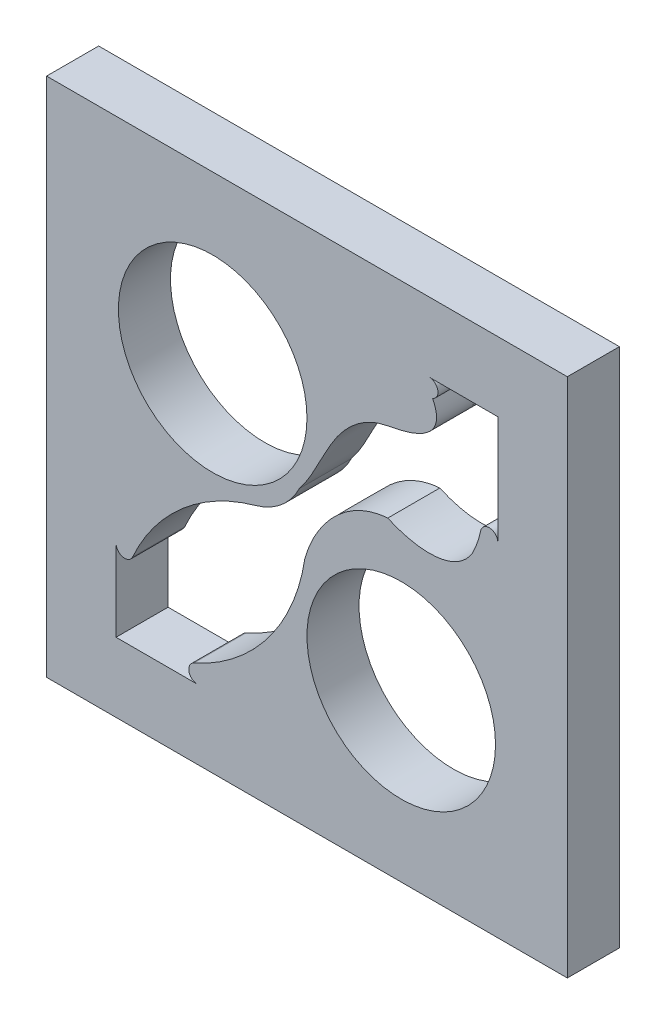
ISO-10303-21;
HEADER;
FILE_DESCRIPTION(('STEP AP214'),'2;1');
FILE_NAME('part.step','',(''),(''),'','','');
FILE_SCHEMA(('AUTOMOTIVE_DESIGN { 1 0 10303 214 1 1 1 1 }'));
ENDSEC;
DATA;
#1=APPLICATION_CONTEXT('core data for automotive mechanical design processes');
#2=APPLICATION_PROTOCOL_DEFINITION('international standard','automotive_design',2000,#1);
#3=PRODUCT_CONTEXT('',#1,'mechanical');
#4=PRODUCT('Part','Part','',(#3));
#5=PRODUCT_RELATED_PRODUCT_CATEGORY('part','',(#4));
#6=PRODUCT_DEFINITION_FORMATION('','',#4);
#7=PRODUCT_DEFINITION_CONTEXT('part definition',#1,'design');
#8=PRODUCT_DEFINITION('design','',#6,#7);
#9=PRODUCT_DEFINITION_SHAPE('','',#8);
#10=(LENGTH_UNIT() NAMED_UNIT(*) SI_UNIT(.MILLI.,.METRE.));
#11=(NAMED_UNIT(*) PLANE_ANGLE_UNIT() SI_UNIT($,.RADIAN.));
#12=(NAMED_UNIT(*) SI_UNIT($,.STERADIAN.) SOLID_ANGLE_UNIT());
#13=UNCERTAINTY_MEASURE_WITH_UNIT(LENGTH_MEASURE(1.E-05),#10,'distance_accuracy_value','');
#14=(GEOMETRIC_REPRESENTATION_CONTEXT(3) GLOBAL_UNCERTAINTY_ASSIGNED_CONTEXT((#13)) GLOBAL_UNIT_ASSIGNED_CONTEXT((#10,
#11,#12)) REPRESENTATION_CONTEXT('',''));
#15=CARTESIAN_POINT('',(0.,0.,0.));
#16=DIRECTION('',(0.,0.,1.));
#17=DIRECTION('',(1.,0.,0.));
#18=AXIS2_PLACEMENT_3D('',#15,#16,#17);
#19=CARTESIAN_POINT('',(15.,0.,3.));
#20=DIRECTION('',(1.,0.,0.));
#21=DIRECTION('',(0.,0.,-1.));
#22=AXIS2_PLACEMENT_3D('',#19,#20,#21);
#23=PLANE('',#22);
#24=DIRECTION('',(0.,-1.,0.));
#25=VECTOR('',#24,1.);
#26=CARTESIAN_POINT('',(15.,0.,0.));
#27=LINE('',#26,#25);
#28=CARTESIAN_POINT('',(15.,15.,0.));
#29=VERTEX_POINT('',#28);
#30=CARTESIAN_POINT('',(15.,-15.,0.));
#31=VERTEX_POINT('',#30);
#32=EDGE_CURVE('E348',#29,#31,#27,.T.);
#33=ORIENTED_EDGE('',*,*,#32,.F.);
#34=DIRECTION('',(0.,0.,-1.));
#35=VECTOR('',#34,1.);
#36=CARTESIAN_POINT('',(15.,15.,3.));
#37=LINE('',#36,#35);
#38=CARTESIAN_POINT('',(15.,15.,3.));
#39=VERTEX_POINT('',#38);
#40=EDGE_CURVE('E11',#39,#29,#37,.T.);
#41=ORIENTED_EDGE('',*,*,#40,.F.);
#42=DIRECTION('',(0.,-1.,0.));
#43=VECTOR('',#42,1.);
#44=CARTESIAN_POINT('',(15.,0.,3.));
#45=LINE('',#44,#43);
#46=CARTESIAN_POINT('',(15.,-15.,3.));
#47=VERTEX_POINT('',#46);
#48=EDGE_CURVE('E254',#39,#47,#45,.T.);
#49=ORIENTED_EDGE('',*,*,#48,.T.);
#50=DIRECTION('',(0.,0.,-1.));
#51=VECTOR('',#50,1.);
#52=CARTESIAN_POINT('',(15.,-15.,3.));
#53=LINE('',#52,#51);
#54=EDGE_CURVE('E162',#47,#31,#53,.T.);
#55=ORIENTED_EDGE('',*,*,#54,.T.);
#56=EDGE_LOOP('',(#33,#41,#49,#55));
#57=FACE_BOUND('',#56,.T.);
#58=ADVANCED_FACE('F48',(#57),#23,.T.);
#59=CARTESIAN_POINT('',(0.,15.,3.));
#60=DIRECTION('',(0.,1.,0.));
#61=DIRECTION('',(0.,0.,1.));
#62=AXIS2_PLACEMENT_3D('',#59,#60,#61);
#63=PLANE('',#62);
#64=DIRECTION('',(1.,0.,0.));
#65=VECTOR('',#64,1.);
#66=CARTESIAN_POINT('',(0.,15.,0.));
#67=LINE('',#66,#65);
#68=CARTESIAN_POINT('',(-15.,15.,0.));
#69=VERTEX_POINT('',#68);
#70=EDGE_CURVE('E241',#69,#29,#67,.T.);
#71=ORIENTED_EDGE('',*,*,#70,.F.);
#72=DIRECTION('',(0.,0.,-1.));
#73=VECTOR('',#72,1.);
#74=CARTESIAN_POINT('',(-15.,15.,3.));
#75=LINE('',#74,#73);
#76=CARTESIAN_POINT('',(-15.,15.,3.));
#77=VERTEX_POINT('',#76);
#78=EDGE_CURVE('E59',#77,#69,#75,.T.);
#79=ORIENTED_EDGE('',*,*,#78,.F.);
#80=DIRECTION('',(1.,0.,0.));
#81=VECTOR('',#80,1.);
#82=CARTESIAN_POINT('',(0.,15.,3.));
#83=LINE('',#82,#81);
#84=EDGE_CURVE('E239',#77,#39,#83,.T.);
#85=ORIENTED_EDGE('',*,*,#84,.T.);
#86=ORIENTED_EDGE('',*,*,#40,.T.);
#87=EDGE_LOOP('',(#71,#79,#85,#86));
#88=FACE_BOUND('',#87,.T.);
#89=ADVANCED_FACE('F237',(#88),#63,.T.);
#90=CARTESIAN_POINT('',(-15.,0.,3.));
#91=DIRECTION('',(1.,0.,0.));
#92=DIRECTION('',(0.,1.,0.));
#93=AXIS2_PLACEMENT_3D('',#90,#91,#92);
#94=PLANE('',#93);
#95=DIRECTION('',(0.,-1.,0.));
#96=VECTOR('',#95,1.);
#97=CARTESIAN_POINT('',(-15.,0.,0.));
#98=LINE('',#97,#96);
#99=CARTESIAN_POINT('',(-15.,-15.,0.));
#100=VERTEX_POINT('',#99);
#101=EDGE_CURVE('E353',#69,#100,#98,.T.);
#102=ORIENTED_EDGE('',*,*,#101,.T.);
#103=DIRECTION('',(0.,0.,-1.));
#104=VECTOR('',#103,1.);
#105=CARTESIAN_POINT('',(-15.,-15.,3.));
#106=LINE('',#105,#104);
#107=CARTESIAN_POINT('',(-15.,-15.,3.));
#108=VERTEX_POINT('',#107);
#109=EDGE_CURVE('E245',#108,#100,#106,.T.);
#110=ORIENTED_EDGE('',*,*,#109,.F.);
#111=DIRECTION('',(0.,-1.,0.));
#112=VECTOR('',#111,1.);
#113=CARTESIAN_POINT('',(-15.,0.,3.));
#114=LINE('',#113,#112);
#115=EDGE_CURVE('E248',#77,#108,#114,.T.);
#116=ORIENTED_EDGE('',*,*,#115,.F.);
#117=ORIENTED_EDGE('',*,*,#78,.T.);
#118=EDGE_LOOP('',(#102,#110,#116,#117));
#119=FACE_BOUND('',#118,.T.);
#120=ADVANCED_FACE('F249',(#119),#94,.F.);
#121=CARTESIAN_POINT('',(0.,-11.,3.));
#122=DIRECTION('',(0.,1.,0.));
#123=DIRECTION('',(0.,0.,1.));
#124=AXIS2_PLACEMENT_3D('',#121,#122,#123);
#125=PLANE('',#124);
#126=DIRECTION('',(1.,0.,0.));
#127=VECTOR('',#126,1.);
#128=CARTESIAN_POINT('',(0.,-11.,0.));
#129=LINE('',#128,#127);
#130=CARTESIAN_POINT('',(-11.,-11.,0.));
#131=VERTEX_POINT('',#130);
#132=CARTESIAN_POINT('',(-6.30958424017658,-11.,0.));
#133=VERTEX_POINT('',#132);
#134=EDGE_CURVE('E271',#131,#133,#129,.T.);
#135=ORIENTED_EDGE('',*,*,#134,.F.);
#136=DIRECTION('',(0.,0.,-1.));
#137=VECTOR('',#136,1.);
#138=CARTESIAN_POINT('',(-11.,-11.,3.));
#139=LINE('',#138,#137);
#140=CARTESIAN_POINT('',(-11.,-11.,3.));
#141=VERTEX_POINT('',#140);
#142=EDGE_CURVE('E52',#141,#131,#139,.T.);
#143=ORIENTED_EDGE('',*,*,#142,.F.);
#144=DIRECTION('',(1.,0.,0.));
#145=VECTOR('',#144,1.);
#146=CARTESIAN_POINT('',(0.,-11.,3.));
#147=LINE('',#146,#145);
#148=CARTESIAN_POINT('',(-6.30958424017658,-11.,3.));
#149=VERTEX_POINT('',#148);
#150=EDGE_CURVE('E362',#141,#149,#147,.T.);
#151=ORIENTED_EDGE('',*,*,#150,.T.);
#152=DIRECTION('',(0.,0.,-1.));
#153=VECTOR('',#152,1.);
#154=CARTESIAN_POINT('',(-6.30958424017658,-11.,3.));
#155=LINE('',#154,#153);
#156=EDGE_CURVE('E270',#149,#133,#155,.T.);
#157=ORIENTED_EDGE('',*,*,#156,.T.);
#158=EDGE_LOOP('',(#135,#143,#151,#157));
#159=FACE_BOUND('',#158,.T.);
#160=ADVANCED_FACE('F50',(#159),#125,.T.);
#161=CARTESIAN_POINT('',(-11.,0.,3.));
#162=DIRECTION('',(1.,0.,0.));
#163=DIRECTION('',(0.,0.,-1.));
#164=AXIS2_PLACEMENT_3D('',#161,#162,#163);
#165=PLANE('',#164);
#166=DIRECTION('',(0.,-1.,0.));
#167=VECTOR('',#166,1.);
#168=CARTESIAN_POINT('',(-11.,0.,0.));
#169=LINE('',#168,#167);
#170=CARTESIAN_POINT('',(-11.,-6.30958424017659,0.));
#171=VERTEX_POINT('',#170);
#172=EDGE_CURVE('E274',#171,#131,#169,.T.);
#173=ORIENTED_EDGE('',*,*,#172,.F.);
#174=DIRECTION('',(0.,0.,-1.));
#175=VECTOR('',#174,1.);
#176=CARTESIAN_POINT('',(-11.,-6.30958424017659,3.));
#177=LINE('',#176,#175);
#178=CARTESIAN_POINT('',(-11.,-6.30958424017659,3.));
#179=VERTEX_POINT('',#178);
#180=EDGE_CURVE('E405',#179,#171,#177,.T.);
#181=ORIENTED_EDGE('',*,*,#180,.F.);
#182=DIRECTION('',(0.,-1.,0.));
#183=VECTOR('',#182,1.);
#184=CARTESIAN_POINT('',(-11.,0.,3.));
#185=LINE('',#184,#183);
#186=EDGE_CURVE('E420',#179,#141,#185,.T.);
#187=ORIENTED_EDGE('',*,*,#186,.T.);
#188=ORIENTED_EDGE('',*,*,#142,.T.);
#189=EDGE_LOOP('',(#173,#181,#187,#188));
#190=FACE_BOUND('',#189,.T.);
#191=ADVANCED_FACE('F418',(#190),#165,.T.);
#192=CARTESIAN_POINT('',(-10.5,-6.30958424017659,3.));
#193=DIRECTION('',(0.,0.,-1.));
#194=DIRECTION('',(-1.,0.,0.));
#195=AXIS2_PLACEMENT_3D('',#192,#193,#194);
#196=CYLINDRICAL_SURFACE('',#195,0.500000000000001);
#197=CARTESIAN_POINT('',(-10.5,-6.30958424017659,0.));
#198=DIRECTION('',(0.,0.,1.));
#199=DIRECTION('',(1.,0.,0.));
#200=AXIS2_PLACEMENT_3D('',#197,#198,#199);
#201=CIRCLE('',#200,0.500000000000001);
#202=CARTESIAN_POINT('',(-10.0434782608695,-6.51351536016893,0.));
#203=VERTEX_POINT('',#202);
#204=EDGE_CURVE('E278',#171,#203,#201,.T.);
#205=ORIENTED_EDGE('',*,*,#204,.T.);
#206=DIRECTION('',(0.,0.,-1.));
#207=VECTOR('',#206,1.);
#208=CARTESIAN_POINT('',(-10.0434782608695,-6.51351536016893,3.));
#209=LINE('',#208,#207);
#210=CARTESIAN_POINT('',(-10.0434782608695,-6.51351536016893,3.));
#211=VERTEX_POINT('',#210);
#212=EDGE_CURVE('E402',#211,#203,#209,.T.);
#213=ORIENTED_EDGE('',*,*,#212,.F.);
#214=CARTESIAN_POINT('',(-10.5,-6.30958424017659,3.));
#215=DIRECTION('',(0.,0.,1.));
#216=DIRECTION('',(1.,0.,0.));
#217=AXIS2_PLACEMENT_3D('',#214,#215,#216);
#218=CIRCLE('',#217,0.500000000000001);
#219=EDGE_CURVE('E438',#179,#211,#218,.T.);
#220=ORIENTED_EDGE('',*,*,#219,.F.);
#221=ORIENTED_EDGE('',*,*,#180,.T.);
#222=EDGE_LOOP('',(#205,#213,#220,#221));
#223=FACE_BOUND('',#222,.T.);
#224=ADVANCED_FACE('F427',(#223),#196,.T.);
#225=CARTESIAN_POINT('',(7.75421393761633E-13,-11.0000000000002,3.));
#226=DIRECTION('',(0.,0.,-1.));
#227=DIRECTION('',(-1.,0.,0.));
#228=AXIS2_PLACEMENT_3D('',#225,#226,#227);
#229=CYLINDRICAL_SURFACE('',#228,11.0000000000007);
#230=CARTESIAN_POINT('',(7.75421393761633E-13,-11.0000000000002,0.));
#231=DIRECTION('',(0.,0.,1.));
#232=DIRECTION('',(1.,0.,0.));
#233=AXIS2_PLACEMENT_3D('',#230,#231,#232);
#234=CIRCLE('',#233,11.0000000000007);
#235=CARTESIAN_POINT('',(-2.96203037105047,-0.406304890125353,0.));
#236=VERTEX_POINT('',#235);
#237=EDGE_CURVE('E281',#203,#236,#234,.F.);
#238=ORIENTED_EDGE('',*,*,#237,.T.);
#239=DIRECTION('',(0.,0.,-1.));
#240=VECTOR('',#239,1.);
#241=CARTESIAN_POINT('',(-2.96203037105047,-0.406304890125353,3.));
#242=LINE('',#241,#240);
#243=CARTESIAN_POINT('',(-2.96203037105047,-0.406304890125353,3.));
#244=VERTEX_POINT('',#243);
#245=EDGE_CURVE('E399',#244,#236,#242,.T.);
#246=ORIENTED_EDGE('',*,*,#245,.F.);
#247=CARTESIAN_POINT('',(7.75421393761633E-13,-11.0000000000002,3.));
#248=DIRECTION('',(0.,0.,1.));
#249=DIRECTION('',(1.,0.,0.));
#250=AXIS2_PLACEMENT_3D('',#247,#248,#249);
#251=CIRCLE('',#250,11.0000000000007);
#252=EDGE_CURVE('E432',#211,#244,#251,.F.);
#253=ORIENTED_EDGE('',*,*,#252,.F.);
#254=ORIENTED_EDGE('',*,*,#212,.T.);
#255=EDGE_LOOP('',(#238,#246,#253,#254));
#256=FACE_BOUND('',#255,.T.);
#257=ADVANCED_FACE('F430',(#256),#229,.F.);
#258=CARTESIAN_POINT('',(-4.03913232415982,3.44594787710166,3.));
#259=DIRECTION('',(0.,0.,-1.));
#260=DIRECTION('',(-1.,0.,0.));
#261=AXIS2_PLACEMENT_3D('',#258,#259,#260);
#262=CYLINDRICAL_SURFACE('',#261,4.00000000000004);
#263=CARTESIAN_POINT('',(-4.03913232415982,3.44594787710166,0.));
#264=DIRECTION('',(0.,0.,1.));
#265=DIRECTION('',(1.,0.,0.));
#266=AXIS2_PLACEMENT_3D('',#263,#264,#265);
#267=CIRCLE('',#266,4.00000000000004);
#268=CARTESIAN_POINT('',(-0.446038310170015,1.68820062375979,0.));
#269=VERTEX_POINT('',#268);
#270=EDGE_CURVE('E285',#269,#236,#267,.F.);
#271=ORIENTED_EDGE('',*,*,#270,.F.);
#272=DIRECTION('',(0.,0.,-1.));
#273=VECTOR('',#272,1.);
#274=CARTESIAN_POINT('',(-0.446038310170015,1.68820062375979,3.));
#275=LINE('',#274,#273);
#276=CARTESIAN_POINT('',(-0.446038310170015,1.68820062375979,3.));
#277=VERTEX_POINT('',#276);
#278=EDGE_CURVE('E396',#277,#269,#275,.T.);
#279=ORIENTED_EDGE('',*,*,#278,.F.);
#280=CARTESIAN_POINT('',(-4.03913232415982,3.44594787710166,3.));
#281=DIRECTION('',(0.,0.,1.));
#282=DIRECTION('',(1.,0.,0.));
#283=AXIS2_PLACEMENT_3D('',#280,#281,#282);
#284=CIRCLE('',#283,4.00000000000004);
#285=EDGE_CURVE('E437',#277,#244,#284,.F.);
#286=ORIENTED_EDGE('',*,*,#285,.T.);
#287=ORIENTED_EDGE('',*,*,#245,.T.);
#288=EDGE_LOOP('',(#271,#279,#286,#287));
#289=FACE_BOUND('',#288,.T.);
#290=ADVANCED_FACE('F465',(#289),#262,.T.);
#291=CARTESIAN_POINT('',(-0.44603831017005,1.6882006237598,3.));
#292=CARTESIAN_POINT('',(0.60016147174152,2.9977804823151,3.));
#293=CARTESIAN_POINT('',(1.25953540510048,5.41260788195,3.));
#294=CARTESIAN_POINT('',(3.72349140835841,7.26877229624846,3.));
#295=CARTESIAN_POINT('',(6.07500594825596,7.55453411242879,3.));
#296=CARTESIAN_POINT('',(8.01701123165231,8.49972924209482,3.));
#297=CARTESIAN_POINT('',(7.23901025402752,10.0379135700419,3.));
#298=B_SPLINE_CURVE_WITH_KNOTS('',3,(#291,#292,#293,#294,#295,#296,#297),.UNSPECIFIED.,.F.,.F.,
(4,1,1,1,4),(0.,0.408369394247719,0.58400169729789,0.707826514513154,1.),.UNSPECIFIED.);
#299=DIRECTION('',(0.,0.,-1.));
#300=VECTOR('',#299,1.);
#301=SURFACE_OF_LINEAR_EXTRUSION('',#298,#300);
#302=CARTESIAN_POINT('',(-0.44603831017005,1.6882006237598,0.));
#303=CARTESIAN_POINT('',(0.60016147174152,2.9977804823151,0.));
#304=CARTESIAN_POINT('',(1.25953540510048,5.41260788195,0.));
#305=CARTESIAN_POINT('',(3.72349140835841,7.26877229624846,0.));
#306=CARTESIAN_POINT('',(6.07500594825596,7.55453411242879,0.));
#307=CARTESIAN_POINT('',(8.01701123165231,8.49972924209482,0.));
#308=CARTESIAN_POINT('',(7.23901025402752,10.0379135700419,0.));
#309=B_SPLINE_CURVE_WITH_KNOTS('',3,(#302,#303,#304,#305,#306,#307,#308),.UNSPECIFIED.,.F.,.F.,
(4,1,1,1,4),(0.,0.408369394247719,0.58400169729789,0.707826514513154,1.),.UNSPECIFIED.);
#310=CARTESIAN_POINT('',(7.23901025402752,10.0379135700419,0.));
#311=VERTEX_POINT('',#310);
#312=EDGE_CURVE('E289',#269,#311,#309,.T.);
#313=ORIENTED_EDGE('',*,*,#312,.T.);
#314=DIRECTION('',(0.,0.,-1.));
#315=VECTOR('',#314,1.);
#316=CARTESIAN_POINT('',(7.23901025402752,10.0379135700419,3.));
#317=LINE('',#316,#315);
#318=CARTESIAN_POINT('',(7.23901025402752,10.0379135700419,3.));
#319=VERTEX_POINT('',#318);
#320=EDGE_CURVE('E393',#319,#311,#317,.T.);
#321=ORIENTED_EDGE('',*,*,#320,.F.);
#322=EDGE_CURVE('E444',#277,#319,#298,.T.);
#323=ORIENTED_EDGE('',*,*,#322,.F.);
#324=ORIENTED_EDGE('',*,*,#278,.T.);
#325=EDGE_LOOP('',(#313,#321,#323,#324));
#326=FACE_BOUND('',#325,.T.);
#327=ADVANCED_FACE('F460',(#326),#301,.F.);
#328=CARTESIAN_POINT('',(7.04802299987537,10.5,3.));
#329=DIRECTION('',(0.,0.,-1.));
#330=DIRECTION('',(-1.,0.,0.));
#331=AXIS2_PLACEMENT_3D('',#328,#329,#330);
#332=CYLINDRICAL_SURFACE('',#331,0.5);
#333=CARTESIAN_POINT('',(7.04802299987537,10.5,0.));
#334=DIRECTION('',(0.,0.,1.));
#335=DIRECTION('',(1.,0.,0.));
#336=AXIS2_PLACEMENT_3D('',#333,#334,#335);
#337=CIRCLE('',#336,0.5);
#338=CARTESIAN_POINT('',(7.04802299987537,11.,0.));
#339=VERTEX_POINT('',#338);
#340=EDGE_CURVE('E295',#339,#311,#337,.F.);
#341=ORIENTED_EDGE('',*,*,#340,.F.);
#342=DIRECTION('',(0.,0.,-1.));
#343=VECTOR('',#342,1.);
#344=CARTESIAN_POINT('',(7.04802299987537,11.,3.));
#345=LINE('',#344,#343);
#346=CARTESIAN_POINT('',(7.04802299987537,11.,3.));
#347=VERTEX_POINT('',#346);
#348=EDGE_CURVE('E390',#347,#339,#345,.T.);
#349=ORIENTED_EDGE('',*,*,#348,.F.);
#350=CARTESIAN_POINT('',(7.04802299987537,10.5,3.));
#351=DIRECTION('',(0.,0.,1.));
#352=DIRECTION('',(1.,0.,0.));
#353=AXIS2_PLACEMENT_3D('',#350,#351,#352);
#354=CIRCLE('',#353,0.5);
#355=EDGE_CURVE('E454',#347,#319,#354,.F.);
#356=ORIENTED_EDGE('',*,*,#355,.T.);
#357=ORIENTED_EDGE('',*,*,#320,.T.);
#358=EDGE_LOOP('',(#341,#349,#356,#357));
#359=FACE_BOUND('',#358,.T.);
#360=ADVANCED_FACE('F464',(#359),#332,.T.);
#361=CARTESIAN_POINT('',(0.,11.,3.));
#362=DIRECTION('',(0.,-1.,0.));
#363=DIRECTION('',(0.,0.,-1.));
#364=AXIS2_PLACEMENT_3D('',#361,#362,#363);
#365=PLANE('',#364);
#366=DIRECTION('',(-1.,0.,0.));
#367=VECTOR('',#366,1.);
#368=CARTESIAN_POINT('',(0.,11.,0.));
#369=LINE('',#368,#367);
#370=CARTESIAN_POINT('',(11.,11.,0.));
#371=VERTEX_POINT('',#370);
#372=EDGE_CURVE('E302',#371,#339,#369,.T.);
#373=ORIENTED_EDGE('',*,*,#372,.F.);
#374=DIRECTION('',(0.,0.,-1.));
#375=VECTOR('',#374,1.);
#376=CARTESIAN_POINT('',(11.,11.,3.));
#377=LINE('',#376,#375);
#378=CARTESIAN_POINT('',(11.,11.,3.));
#379=VERTEX_POINT('',#378);
#380=EDGE_CURVE('E387',#379,#371,#377,.T.);
#381=ORIENTED_EDGE('',*,*,#380,.F.);
#382=DIRECTION('',(-1.,0.,0.));
#383=VECTOR('',#382,1.);
#384=CARTESIAN_POINT('',(0.,11.,3.));
#385=LINE('',#384,#383);
#386=EDGE_CURVE('E756',#379,#347,#385,.T.);
#387=ORIENTED_EDGE('',*,*,#386,.T.);
#388=ORIENTED_EDGE('',*,*,#348,.T.);
#389=EDGE_LOOP('',(#373,#381,#387,#388));
#390=FACE_BOUND('',#389,.T.);
#391=ADVANCED_FACE('F594',(#390),#365,.T.);
#392=CARTESIAN_POINT('',(11.,0.,3.));
#393=DIRECTION('',(-1.,0.,0.));
#394=DIRECTION('',(0.,0.,1.));
#395=AXIS2_PLACEMENT_3D('',#392,#393,#394);
#396=PLANE('',#395);
#397=DIRECTION('',(0.,1.,0.));
#398=VECTOR('',#397,1.);
#399=CARTESIAN_POINT('',(11.,0.,0.));
#400=LINE('',#399,#398);
#401=CARTESIAN_POINT('',(11.,4.71593342928508,0.));
#402=VERTEX_POINT('',#401);
#403=EDGE_CURVE('E306',#402,#371,#400,.T.);
#404=ORIENTED_EDGE('',*,*,#403,.F.);
#405=DIRECTION('',(0.,0.,-1.));
#406=VECTOR('',#405,1.);
#407=CARTESIAN_POINT('',(11.,4.71593342928508,3.));
#408=LINE('',#407,#406);
#409=CARTESIAN_POINT('',(11.,4.71593342928508,3.));
#410=VERTEX_POINT('',#409);
#411=EDGE_CURVE('E384',#410,#402,#408,.T.);
#412=ORIENTED_EDGE('',*,*,#411,.F.);
#413=DIRECTION('',(0.,1.,0.));
#414=VECTOR('',#413,1.);
#415=CARTESIAN_POINT('',(11.,0.,3.));
#416=LINE('',#415,#414);
#417=EDGE_CURVE('E750',#410,#379,#416,.T.);
#418=ORIENTED_EDGE('',*,*,#417,.T.);
#419=ORIENTED_EDGE('',*,*,#380,.T.);
#420=EDGE_LOOP('',(#404,#412,#418,#419));
#421=FACE_BOUND('',#420,.T.);
#422=ADVANCED_FACE('F603',(#421),#396,.T.);
#423=CARTESIAN_POINT('',(10.5,4.71593342928508,3.));
#424=DIRECTION('',(0.,0.,-1.));
#425=DIRECTION('',(-1.,0.,0.));
#426=AXIS2_PLACEMENT_3D('',#423,#424,#425);
#427=CYLINDRICAL_SURFACE('',#426,0.500000000000001);
#428=CARTESIAN_POINT('',(10.5,4.71593342928508,0.));
#429=DIRECTION('',(0.,0.,1.));
#430=DIRECTION('',(1.,0.,0.));
#431=AXIS2_PLACEMENT_3D('',#428,#429,#430);
#432=CIRCLE('',#431,0.500000000000001);
#433=CARTESIAN_POINT('',(10.0106611914374,4.81863459984584,0.));
#434=VERTEX_POINT('',#433);
#435=EDGE_CURVE('E310',#402,#434,#432,.T.);
#436=ORIENTED_EDGE('',*,*,#435,.T.);
#437=DIRECTION('',(0.,0.,-1.));
#438=VECTOR('',#437,1.);
#439=CARTESIAN_POINT('',(10.0106611914374,4.81863459984584,3.));
#440=LINE('',#439,#438);
#441=CARTESIAN_POINT('',(10.0106611914374,4.81863459984584,3.));
#442=VERTEX_POINT('',#441);
#443=EDGE_CURVE('E381',#442,#434,#440,.T.);
#444=ORIENTED_EDGE('',*,*,#443,.F.);
#445=CARTESIAN_POINT('',(10.5,4.71593342928508,3.));
#446=DIRECTION('',(0.,0.,1.));
#447=DIRECTION('',(1.,0.,0.));
#448=AXIS2_PLACEMENT_3D('',#445,#446,#447);
#449=CIRCLE('',#448,0.500000000000001);
#450=EDGE_CURVE('E746',#410,#442,#449,.T.);
#451=ORIENTED_EDGE('',*,*,#450,.F.);
#452=ORIENTED_EDGE('',*,*,#411,.T.);
#453=EDGE_LOOP('',(#436,#444,#451,#452));
#454=FACE_BOUND('',#453,.T.);
#455=ADVANCED_FACE('F612',(#454),#427,.T.);
#456=CARTESIAN_POINT('',(4.65327762287142,5.94302848401559,3.));
#457=DIRECTION('',(0.,0.,-1.));
#458=DIRECTION('',(-1.,0.,0.));
#459=AXIS2_PLACEMENT_3D('',#456,#457,#458);
#460=CYLINDRICAL_SURFACE('',#459,5.47410452106088);
#461=CARTESIAN_POINT('',(4.65327762287142,5.94302848401559,0.));
#462=DIRECTION('',(0.,0.,1.));
#463=DIRECTION('',(1.,0.,0.));
#464=AXIS2_PLACEMENT_3D('',#461,#462,#463);
#465=CIRCLE('',#464,5.47410452106088);
#466=CARTESIAN_POINT('',(9.52466436075946,3.44594787710123,0.));
#467=VERTEX_POINT('',#466);
#468=EDGE_CURVE('E314',#467,#434,#465,.T.);
#469=ORIENTED_EDGE('',*,*,#468,.F.);
#470=DIRECTION('',(0.,0.,-1.));
#471=VECTOR('',#470,1.);
#472=CARTESIAN_POINT('',(9.52466436075946,3.44594787710123,3.));
#473=LINE('',#472,#471);
#474=CARTESIAN_POINT('',(9.52466436075946,3.44594787710123,3.));
#475=VERTEX_POINT('',#474);
#476=EDGE_CURVE('E378',#475,#467,#473,.T.);
#477=ORIENTED_EDGE('',*,*,#476,.F.);
#478=CARTESIAN_POINT('',(4.65327762287142,5.94302848401559,3.));
#479=DIRECTION('',(0.,0.,1.));
#480=DIRECTION('',(1.,0.,0.));
#481=AXIS2_PLACEMENT_3D('',#478,#479,#480);
#482=CIRCLE('',#481,5.47410452106088);
#483=EDGE_CURVE('E741',#475,#442,#482,.T.);
#484=ORIENTED_EDGE('',*,*,#483,.T.);
#485=ORIENTED_EDGE('',*,*,#443,.T.);
#486=EDGE_LOOP('',(#469,#477,#484,#485));
#487=FACE_BOUND('',#486,.T.);
#488=ADVANCED_FACE('F622',(#487),#460,.F.);
#489=CARTESIAN_POINT('',(4.65327762287142,2.77339702645488,3.));
#490=CARTESIAN_POINT('',(6.13808568691928,2.09656538083828,3.));
#491=CARTESIAN_POINT('',(8.46708858860745,1.75646921422619,3.));
#492=CARTESIAN_POINT('',(9.52466436075946,3.44594787710123,3.));
#493=B_SPLINE_CURVE_WITH_KNOTS('',3,(#489,#490,#491,#492),.UNSPECIFIED.,.F.,.F.,(4,4),(0.,1.),.UNSPECIFIED.);
#494=DIRECTION('',(0.,0.,-1.));
#495=VECTOR('',#494,1.);
#496=SURFACE_OF_LINEAR_EXTRUSION('',#493,#495);
#497=CARTESIAN_POINT('',(4.65327762287142,2.77339702645488,0.));
#498=CARTESIAN_POINT('',(6.13808568691928,2.09656538083828,0.));
#499=CARTESIAN_POINT('',(8.46708858860745,1.75646921422619,0.));
#500=CARTESIAN_POINT('',(9.52466436075946,3.44594787710123,0.));
#501=B_SPLINE_CURVE_WITH_KNOTS('',3,(#497,#498,#499,#500),.UNSPECIFIED.,.F.,.F.,(4,4),(0.,1.),.UNSPECIFIED.);
#502=CARTESIAN_POINT('',(4.65327762287142,2.77339702645488,0.));
#503=VERTEX_POINT('',#502);
#504=EDGE_CURVE('E318',#503,#467,#501,.T.);
#505=ORIENTED_EDGE('',*,*,#504,.F.);
#506=DIRECTION('',(0.,0.,-1.));
#507=VECTOR('',#506,1.);
#508=CARTESIAN_POINT('',(4.65327762287142,2.77339702645488,3.));
#509=LINE('',#508,#507);
#510=CARTESIAN_POINT('',(4.65327762287142,2.77339702645488,3.));
#511=VERTEX_POINT('',#510);
#512=EDGE_CURVE('E375',#511,#503,#509,.T.);
#513=ORIENTED_EDGE('',*,*,#512,.F.);
#514=EDGE_CURVE('E515',#511,#475,#493,.T.);
#515=ORIENTED_EDGE('',*,*,#514,.T.);
#516=ORIENTED_EDGE('',*,*,#476,.T.);
#517=EDGE_LOOP('',(#505,#513,#515,#516));
#518=FACE_BOUND('',#517,.T.);
#519=ADVANCED_FACE('F503',(#518),#496,.T.);
#520=CARTESIAN_POINT('',(-0.30918123589576,-2.58967066498206,3.));
#521=CARTESIAN_POINT('',(-0.0128231042816666,-0.0523110228744025,3.));
#522=CARTESIAN_POINT('',(1.95463403283617,2.59123348225443,3.));
#523=CARTESIAN_POINT('',(4.65327762287142,2.77339702645488,3.));
#524=B_SPLINE_CURVE_WITH_KNOTS('',3,(#520,#521,#522,#523),.UNSPECIFIED.,.F.,.F.,(4,4),(0.,1.),.UNSPECIFIED.);
#525=DIRECTION('',(0.,0.,-1.));
#526=VECTOR('',#525,1.);
#527=SURFACE_OF_LINEAR_EXTRUSION('',#524,#526);
#528=CARTESIAN_POINT('',(-0.30918123589576,-2.58967066498206,0.));
#529=CARTESIAN_POINT('',(-0.0128231042816666,-0.0523110228744025,0.));
#530=CARTESIAN_POINT('',(1.95463403283617,2.59123348225443,0.));
#531=CARTESIAN_POINT('',(4.65327762287142,2.77339702645488,0.));
#532=B_SPLINE_CURVE_WITH_KNOTS('',3,(#528,#529,#530,#531),.UNSPECIFIED.,.F.,.F.,(4,4),(0.,1.),.UNSPECIFIED.);
#533=CARTESIAN_POINT('',(-0.124019496663194,-1.64713329485766,0.));
#534=VERTEX_POINT('',#533);
#535=EDGE_CURVE('E324',#534,#503,#532,.T.);
#536=ORIENTED_EDGE('',*,*,#535,.F.);
#537=DIRECTION('',(0.,0.,-1.));
#538=VECTOR('',#537,1.);
#539=CARTESIAN_POINT('',(-0.124019496663194,-1.64713329485766,3.));
#540=LINE('',#539,#538);
#541=CARTESIAN_POINT('',(-0.124019496663194,-1.64713329485766,3.));
#542=VERTEX_POINT('',#541);
#543=EDGE_CURVE('E372',#542,#534,#540,.T.);
#544=ORIENTED_EDGE('',*,*,#543,.F.);
#545=EDGE_CURVE('E507',#542,#511,#524,.T.);
#546=ORIENTED_EDGE('',*,*,#545,.T.);
#547=ORIENTED_EDGE('',*,*,#512,.T.);
#548=EDGE_LOOP('',(#536,#544,#546,#547));
#549=FACE_BOUND('',#548,.T.);
#550=ADVANCED_FACE('F498',(#549),#527,.T.);
#551=CARTESIAN_POINT('',(-10.9999999999999,-5.86436092923128E-13,3.));
#552=DIRECTION('',(0.,0.,-1.));
#553=DIRECTION('',(-1.,0.,0.));
#554=AXIS2_PLACEMENT_3D('',#551,#552,#553);
#555=CYLINDRICAL_SURFACE('',#554,10.9999999999994);
#556=CARTESIAN_POINT('',(-10.9999999999999,-5.86436092923128E-13,0.));
#557=DIRECTION('',(0.,0.,1.));
#558=DIRECTION('',(1.,0.,0.));
#559=AXIS2_PLACEMENT_3D('',#556,#557,#558);
#560=CIRCLE('',#559,10.9999999999994);
#561=CARTESIAN_POINT('',(-6.51351536016891,-10.0434782608696,0.));
#562=VERTEX_POINT('',#561);
#563=EDGE_CURVE('E333',#562,#534,#560,.T.);
#564=ORIENTED_EDGE('',*,*,#563,.F.);
#565=DIRECTION('',(0.,0.,-1.));
#566=VECTOR('',#565,1.);
#567=CARTESIAN_POINT('',(-6.51351536016891,-10.0434782608696,3.));
#568=LINE('',#567,#566);
#569=CARTESIAN_POINT('',(-6.51351536016891,-10.0434782608696,3.));
#570=VERTEX_POINT('',#569);
#571=EDGE_CURVE('E369',#570,#562,#568,.T.);
#572=ORIENTED_EDGE('',*,*,#571,.F.);
#573=CARTESIAN_POINT('',(-10.9999999999999,-5.86436092923128E-13,3.));
#574=DIRECTION('',(0.,0.,1.));
#575=DIRECTION('',(1.,0.,0.));
#576=AXIS2_PLACEMENT_3D('',#573,#574,#575);
#577=CIRCLE('',#576,10.9999999999994);
#578=EDGE_CURVE('E514',#570,#542,#577,.T.);
#579=ORIENTED_EDGE('',*,*,#578,.T.);
#580=ORIENTED_EDGE('',*,*,#543,.T.);
#581=EDGE_LOOP('',(#564,#572,#579,#580));
#582=FACE_BOUND('',#581,.T.);
#583=ADVANCED_FACE('F495',(#582),#555,.F.);
#584=CARTESIAN_POINT('',(0.,-15.,3.));
#585=DIRECTION('',(0.,1.,0.));
#586=DIRECTION('',(0.,0.,1.));
#587=AXIS2_PLACEMENT_3D('',#584,#585,#586);
#588=PLANE('',#587);
#589=DIRECTION('',(1.,0.,0.));
#590=VECTOR('',#589,1.);
#591=CARTESIAN_POINT('',(0.,-15.,0.));
#592=LINE('',#591,#590);
#593=EDGE_CURVE('E153',#100,#31,#592,.T.);
#594=ORIENTED_EDGE('',*,*,#593,.T.);
#595=ORIENTED_EDGE('',*,*,#54,.F.);
#596=DIRECTION('',(1.,0.,0.));
#597=VECTOR('',#596,1.);
#598=CARTESIAN_POINT('',(0.,-15.,3.));
#599=LINE('',#598,#597);
#600=EDGE_CURVE('E72',#108,#47,#599,.T.);
#601=ORIENTED_EDGE('',*,*,#600,.F.);
#602=ORIENTED_EDGE('',*,*,#109,.T.);
#603=EDGE_LOOP('',(#594,#595,#601,#602));
#604=FACE_BOUND('',#603,.T.);
#605=ADVANCED_FACE('F489',(#604),#588,.F.);
#606=CARTESIAN_POINT('',(5.4314485195137,-5.43144851951369,3.));
#607=DIRECTION('',(0.,0.,-1.));
#608=DIRECTION('',(-1.,0.,0.));
#609=AXIS2_PLACEMENT_3D('',#606,#607,#608);
#610=CYLINDRICAL_SURFACE('',#609,5.4314485195137);
#611=CARTESIAN_POINT('',(5.4314485195137,-5.43144851951369,3.));
#612=DIRECTION('',(0.,0.,1.));
#613=DIRECTION('',(1.,0.,0.));
#614=AXIS2_PLACEMENT_3D('',#611,#612,#613);
#615=CIRCLE('',#614,5.4314485195137);
#616=CARTESIAN_POINT('',(10.8628970390274,-5.43144851951369,3.));
#617=VERTEX_POINT('',#616);
#618=EDGE_CURVE('E260',#617,#617,#615,.T.);
#619=ORIENTED_EDGE('',*,*,#618,.T.);
#620=EDGE_LOOP('',(#619));
#621=FACE_BOUND('',#620,.T.);
#622=CARTESIAN_POINT('',(5.4314485195137,-5.43144851951369,0.));
#623=DIRECTION('',(0.,0.,1.));
#624=DIRECTION('',(1.,0.,0.));
#625=AXIS2_PLACEMENT_3D('',#622,#623,#624);
#626=CIRCLE('',#625,5.4314485195137);
#627=CARTESIAN_POINT('',(10.8628970390274,-5.43144851951369,0.));
#628=VERTEX_POINT('',#627);
#629=EDGE_CURVE('E344',#628,#628,#626,.T.);
#630=ORIENTED_EDGE('',*,*,#629,.F.);
#631=EDGE_LOOP('',(#630));
#632=FACE_BOUND('',#631,.T.);
#633=ADVANCED_FACE('F485',(#621,#632),#610,.F.);
#634=CARTESIAN_POINT('',(-6.30958424017658,-10.5,3.));
#635=DIRECTION('',(0.,0.,-1.));
#636=DIRECTION('',(-1.,0.,0.));
#637=AXIS2_PLACEMENT_3D('',#634,#635,#636);
#638=CYLINDRICAL_SURFACE('',#637,0.5);
#639=CARTESIAN_POINT('',(-6.30958424017658,-10.5,0.));
#640=DIRECTION('',(0.,0.,1.));
#641=DIRECTION('',(1.,0.,0.));
#642=AXIS2_PLACEMENT_3D('',#639,#640,#641);
#643=CIRCLE('',#642,0.5);
#644=EDGE_CURVE('E340',#133,#562,#643,.F.);
#645=ORIENTED_EDGE('',*,*,#644,.F.);
#646=ORIENTED_EDGE('',*,*,#156,.F.);
#647=CARTESIAN_POINT('',(-6.30958424017658,-10.5,3.));
#648=DIRECTION('',(0.,0.,1.));
#649=DIRECTION('',(1.,0.,0.));
#650=AXIS2_PLACEMENT_3D('',#647,#648,#649);
#651=CIRCLE('',#650,0.5);
#652=EDGE_CURVE('E526',#149,#570,#651,.F.);
#653=ORIENTED_EDGE('',*,*,#652,.T.);
#654=ORIENTED_EDGE('',*,*,#571,.T.);
#655=EDGE_LOOP('',(#645,#646,#653,#654));
#656=FACE_BOUND('',#655,.T.);
#657=ADVANCED_FACE('F488',(#656),#638,.T.);
#658=CARTESIAN_POINT('',(-5.43144851951369,5.43144851951369,3.));
#659=DIRECTION('',(0.,0.,-1.));
#660=DIRECTION('',(-1.,0.,0.));
#661=AXIS2_PLACEMENT_3D('',#658,#659,#660);
#662=CYLINDRICAL_SURFACE('',#661,5.43144851951369);
#663=CARTESIAN_POINT('',(-5.43144851951369,5.43144851951369,3.));
#664=DIRECTION('',(0.,0.,1.));
#665=DIRECTION('',(1.,0.,0.));
#666=AXIS2_PLACEMENT_3D('',#663,#664,#665);
#667=CIRCLE('',#666,5.43144851951369);
#668=CARTESIAN_POINT('',(0.,5.43144851951369,3.));
#669=VERTEX_POINT('',#668);
#670=EDGE_CURVE('E266',#669,#669,#667,.F.);
#671=ORIENTED_EDGE('',*,*,#670,.F.);
#672=EDGE_LOOP('',(#671));
#673=FACE_BOUND('',#672,.T.);
#674=CARTESIAN_POINT('',(-5.43144851951369,5.43144851951369,0.));
#675=DIRECTION('',(0.,0.,1.));
#676=DIRECTION('',(1.,0.,0.));
#677=AXIS2_PLACEMENT_3D('',#674,#675,#676);
#678=CIRCLE('',#677,5.43144851951369);
#679=CARTESIAN_POINT('',(0.,5.43144851951369,0.));
#680=VERTEX_POINT('',#679);
#681=EDGE_CURVE('E358',#680,#680,#678,.F.);
#682=ORIENTED_EDGE('',*,*,#681,.T.);
#683=EDGE_LOOP('',(#682));
#684=FACE_BOUND('',#683,.T.);
#685=ADVANCED_FACE('F493',(#673,#684),#662,.F.);
#686=CARTESIAN_POINT('',(0.,0.,3.));
#687=DIRECTION('',(0.,0.,1.));
#688=DIRECTION('',(1.,0.,0.));
#689=AXIS2_PLACEMENT_3D('',#686,#687,#688);
#690=PLANE('',#689);
#691=ORIENTED_EDGE('',*,*,#150,.F.);
#692=ORIENTED_EDGE('',*,*,#186,.F.);
#693=ORIENTED_EDGE('',*,*,#219,.T.);
#694=ORIENTED_EDGE('',*,*,#252,.T.);
#695=ORIENTED_EDGE('',*,*,#285,.F.);
#696=ORIENTED_EDGE('',*,*,#322,.T.);
#697=ORIENTED_EDGE('',*,*,#355,.F.);
#698=ORIENTED_EDGE('',*,*,#386,.F.);
#699=ORIENTED_EDGE('',*,*,#417,.F.);
#700=ORIENTED_EDGE('',*,*,#450,.T.);
#701=ORIENTED_EDGE('',*,*,#483,.F.);
#702=ORIENTED_EDGE('',*,*,#514,.F.);
#703=ORIENTED_EDGE('',*,*,#545,.F.);
#704=ORIENTED_EDGE('',*,*,#578,.F.);
#705=ORIENTED_EDGE('',*,*,#652,.F.);
#706=EDGE_LOOP('',(#691,#692,#693,#694,#695,#696,#697,#698,#699,#700,#701,#702,#703,#704,#705));
#707=FACE_BOUND('',#706,.T.);
#708=ORIENTED_EDGE('',*,*,#618,.F.);
#709=EDGE_LOOP('',(#708));
#710=FACE_BOUND('',#709,.T.);
#711=ORIENTED_EDGE('',*,*,#48,.F.);
#712=ORIENTED_EDGE('',*,*,#84,.F.);
#713=ORIENTED_EDGE('',*,*,#115,.T.);
#714=ORIENTED_EDGE('',*,*,#600,.T.);
#715=EDGE_LOOP('',(#711,#712,#713,#714));
#716=FACE_BOUND('',#715,.T.);
#717=ORIENTED_EDGE('',*,*,#670,.T.);
#718=EDGE_LOOP('',(#717));
#719=FACE_BOUND('',#718,.T.);
#720=ADVANCED_FACE('F252',(#707,#710,#716,#719),#690,.T.);
#721=CARTESIAN_POINT('',(0.,0.,0.));
#722=DIRECTION('',(0.,0.,1.));
#723=DIRECTION('',(1.,0.,0.));
#724=AXIS2_PLACEMENT_3D('',#721,#722,#723);
#725=PLANE('',#724);
#726=ORIENTED_EDGE('',*,*,#134,.T.);
#727=ORIENTED_EDGE('',*,*,#644,.T.);
#728=ORIENTED_EDGE('',*,*,#563,.T.);
#729=ORIENTED_EDGE('',*,*,#535,.T.);
#730=ORIENTED_EDGE('',*,*,#504,.T.);
#731=ORIENTED_EDGE('',*,*,#468,.T.);
#732=ORIENTED_EDGE('',*,*,#435,.F.);
#733=ORIENTED_EDGE('',*,*,#403,.T.);
#734=ORIENTED_EDGE('',*,*,#372,.T.);
#735=ORIENTED_EDGE('',*,*,#340,.T.);
#736=ORIENTED_EDGE('',*,*,#312,.F.);
#737=ORIENTED_EDGE('',*,*,#270,.T.);
#738=ORIENTED_EDGE('',*,*,#237,.F.);
#739=ORIENTED_EDGE('',*,*,#204,.F.);
#740=ORIENTED_EDGE('',*,*,#172,.T.);
#741=EDGE_LOOP('',(#726,#727,#728,#729,#730,#731,#732,#733,#734,#735,#736,#737,#738,#739,#740));
#742=FACE_BOUND('',#741,.T.);
#743=ORIENTED_EDGE('',*,*,#629,.T.);
#744=EDGE_LOOP('',(#743));
#745=FACE_BOUND('',#744,.T.);
#746=ORIENTED_EDGE('',*,*,#32,.T.);
#747=ORIENTED_EDGE('',*,*,#593,.F.);
#748=ORIENTED_EDGE('',*,*,#101,.F.);
#749=ORIENTED_EDGE('',*,*,#70,.T.);
#750=EDGE_LOOP('',(#746,#747,#748,#749));
#751=FACE_BOUND('',#750,.T.);
#752=ORIENTED_EDGE('',*,*,#681,.F.);
#753=EDGE_LOOP('',(#752));
#754=FACE_BOUND('',#753,.T.);
#755=ADVANCED_FACE('F423',(#742,#745,#751,#754),#725,.F.);
#756=CLOSED_SHELL('',(#58,#89,#120,#160,#191,#224,#257,#290,#327,#360,#391,#422,#455,#488,#519,
#550,#583,#605,#633,#657,#685,#720,#755));
#757=MANIFOLD_SOLID_BREP('B2',#756);
#758=ADVANCED_BREP_SHAPE_REPRESENTATION('',(#18,#757),#14);
#759=SHAPE_DEFINITION_REPRESENTATION(#9,#758);
ENDSEC;
END-ISO-10303-21;
